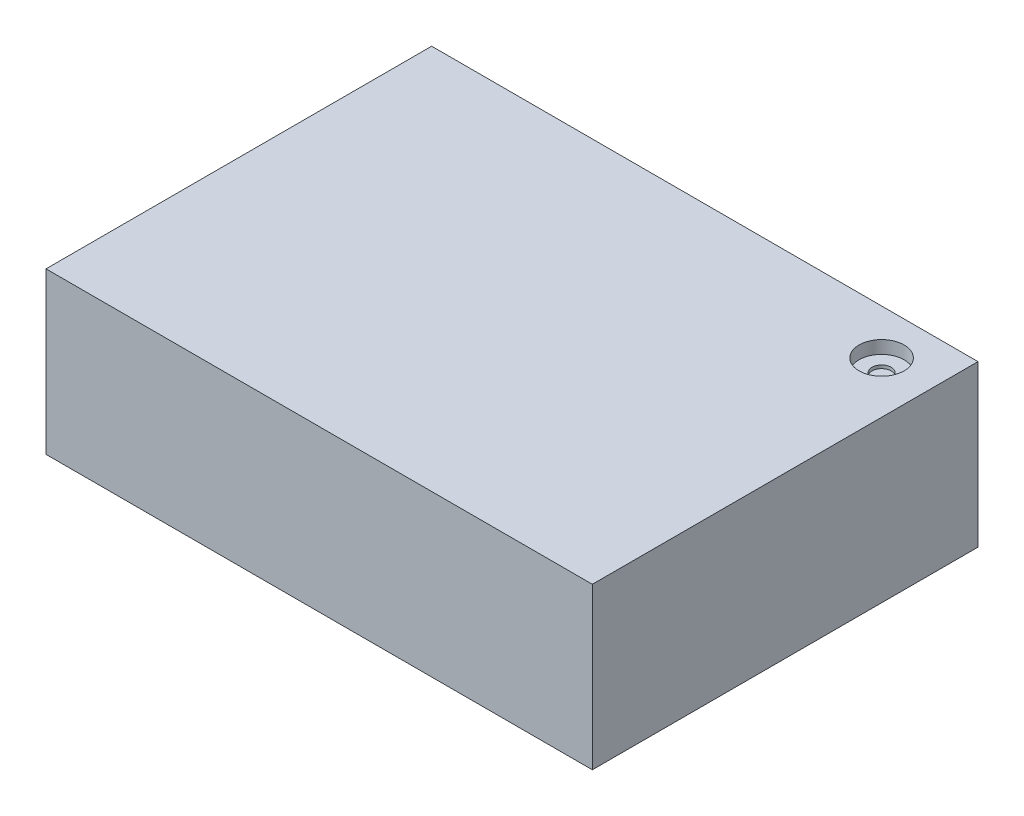
ISO-10303-21;
HEADER;
FILE_DESCRIPTION(('STEP AP214'),'2;1');
FILE_NAME('part.step','',(''),(''),'','','');
FILE_SCHEMA(('AUTOMOTIVE_DESIGN { 1 0 10303 214 1 1 1 1 }'));
ENDSEC;
DATA;
#1=APPLICATION_CONTEXT('core data for automotive mechanical design processes');
#2=APPLICATION_PROTOCOL_DEFINITION('international standard','automotive_design',2000,#1);
#3=PRODUCT_CONTEXT('',#1,'mechanical');
#4=PRODUCT('Part','Part','',(#3));
#5=PRODUCT_RELATED_PRODUCT_CATEGORY('part','',(#4));
#6=PRODUCT_DEFINITION_FORMATION('','',#4);
#7=PRODUCT_DEFINITION_CONTEXT('part definition',#1,'design');
#8=PRODUCT_DEFINITION('design','',#6,#7);
#9=PRODUCT_DEFINITION_SHAPE('','',#8);
#10=(LENGTH_UNIT() NAMED_UNIT(*) SI_UNIT(.MILLI.,.METRE.));
#11=(NAMED_UNIT(*) PLANE_ANGLE_UNIT() SI_UNIT($,.RADIAN.));
#12=(NAMED_UNIT(*) SI_UNIT($,.STERADIAN.) SOLID_ANGLE_UNIT());
#13=UNCERTAINTY_MEASURE_WITH_UNIT(LENGTH_MEASURE(1.E-05),#10,'distance_accuracy_value','');
#14=(GEOMETRIC_REPRESENTATION_CONTEXT(3) GLOBAL_UNCERTAINTY_ASSIGNED_CONTEXT((#13)) GLOBAL_UNIT_ASSIGNED_CONTEXT((#10,
#11,#12)) REPRESENTATION_CONTEXT('',''));
#15=CARTESIAN_POINT('',(0.,0.,0.));
#16=DIRECTION('',(0.,0.,1.));
#17=DIRECTION('',(1.,0.,0.));
#18=AXIS2_PLACEMENT_3D('',#15,#16,#17);
#19=CARTESIAN_POINT('',(43.815,0.,-29.21));
#20=DIRECTION('',(0.,1.,0.));
#21=DIRECTION('',(0.,0.,1.));
#22=AXIS2_PLACEMENT_3D('',#19,#20,#21);
#23=CYLINDRICAL_SURFACE('',#22,1.8923);
#24=CARTESIAN_POINT('',(43.815,28.575,-29.21));
#25=DIRECTION('',(0.,1.,0.));
#26=DIRECTION('',(0.,0.,1.));
#27=AXIS2_PLACEMENT_3D('',#24,#25,#26);
#28=CIRCLE('',#27,1.8923);
#29=CARTESIAN_POINT('',(43.815,28.575,-27.3177));
#30=VERTEX_POINT('',#29);
#31=EDGE_CURVE('E252',#30,#30,#28,.T.);
#32=ORIENTED_EDGE('',*,*,#31,.F.);
#33=EDGE_LOOP('',(#32));
#34=FACE_BOUND('',#33,.T.);
#35=CARTESIAN_POINT('',(43.815,29.21,-29.21));
#36=DIRECTION('',(0.,1.,0.));
#37=DIRECTION('',(0.,0.,1.));
#38=AXIS2_PLACEMENT_3D('',#35,#36,#37);
#39=CIRCLE('',#38,1.8923);
#40=CARTESIAN_POINT('',(43.815,29.21,-27.3177));
#41=VERTEX_POINT('',#40);
#42=EDGE_CURVE('E41',#41,#41,#39,.F.);
#43=ORIENTED_EDGE('',*,*,#42,.F.);
#44=EDGE_LOOP('',(#43));
#45=FACE_BOUND('',#44,.T.);
#46=ADVANCED_FACE('F37',(#34,#45),#23,.F.);
#47=CARTESIAN_POINT('',(53.975,31.75,-38.1));
#48=DIRECTION('',(-1.,0.,0.));
#49=DIRECTION('',(0.,0.,1.));
#50=AXIS2_PLACEMENT_3D('',#47,#48,#49);
#51=PLANE('',#50);
#52=DIRECTION('',(0.,0.,-1.));
#53=VECTOR('',#52,1.);
#54=CARTESIAN_POINT('',(53.975,0.,-38.1));
#55=LINE('',#54,#53);
#56=CARTESIAN_POINT('',(53.975,0.,38.1));
#57=VERTEX_POINT('',#56);
#58=CARTESIAN_POINT('',(53.975,0.,-38.1));
#59=VERTEX_POINT('',#58);
#60=EDGE_CURVE('E290',#57,#59,#55,.T.);
#61=ORIENTED_EDGE('',*,*,#60,.T.);
#62=DIRECTION('',(0.,-1.,0.));
#63=VECTOR('',#62,1.);
#64=CARTESIAN_POINT('',(53.975,31.75,-38.1));
#65=LINE('',#64,#63);
#66=CARTESIAN_POINT('',(53.975,31.75,-38.1));
#67=VERTEX_POINT('',#66);
#68=EDGE_CURVE('E12',#67,#59,#65,.T.);
#69=ORIENTED_EDGE('',*,*,#68,.F.);
#70=DIRECTION('',(0.,0.,-1.));
#71=VECTOR('',#70,1.);
#72=CARTESIAN_POINT('',(53.975,31.75,-38.1));
#73=LINE('',#72,#71);
#74=CARTESIAN_POINT('',(53.975,31.75,38.1));
#75=VERTEX_POINT('',#74);
#76=EDGE_CURVE('E291',#75,#67,#73,.T.);
#77=ORIENTED_EDGE('',*,*,#76,.F.);
#78=DIRECTION('',(0.,-1.,0.));
#79=VECTOR('',#78,1.);
#80=CARTESIAN_POINT('',(53.975,31.75,38.1));
#81=LINE('',#80,#79);
#82=EDGE_CURVE('E301',#75,#57,#81,.T.);
#83=ORIENTED_EDGE('',*,*,#82,.T.);
#84=EDGE_LOOP('',(#61,#69,#77,#83));
#85=FACE_BOUND('',#84,.T.);
#86=ADVANCED_FACE('F39',(#85),#51,.F.);
#87=CARTESIAN_POINT('',(-53.975,31.75,-38.1));
#88=DIRECTION('',(0.,0.,1.));
#89=DIRECTION('',(1.,0.,0.));
#90=AXIS2_PLACEMENT_3D('',#87,#88,#89);
#91=PLANE('',#90);
#92=DIRECTION('',(0.,1.,0.));
#93=VECTOR('',#92,1.);
#94=CARTESIAN_POINT('',(50.8,21.3783333333333,-38.0999999999999));
#95=LINE('',#94,#93);
#96=CARTESIAN_POINT('',(50.8,15.6633333333333,-38.0999999999999));
#97=VERTEX_POINT('',#96);
#98=CARTESIAN_POINT('',(50.8,21.3783333333333,-38.0999999999999));
#99=VERTEX_POINT('',#98);
#100=EDGE_CURVE('E216',#97,#99,#95,.T.);
#101=ORIENTED_EDGE('',*,*,#100,.T.);
#102=DIRECTION('',(-1.,0.,0.));
#103=VECTOR('',#102,1.);
#104=CARTESIAN_POINT('',(127.223289058517,21.3783333333333,-38.0999999999999));
#105=LINE('',#104,#103);
#106=CARTESIAN_POINT('',(-53.975,21.3783333333333,-38.0999999999999));
#107=VERTEX_POINT('',#106);
#108=EDGE_CURVE('E208',#99,#107,#105,.T.);
#109=ORIENTED_EDGE('',*,*,#108,.T.);
#110=DIRECTION('',(0.,-1.,0.));
#111=VECTOR('',#110,1.);
#112=CARTESIAN_POINT('',(-53.975,31.75,-38.1));
#113=LINE('',#112,#111);
#114=CARTESIAN_POINT('',(-53.975,22.86,-38.1));
#115=VERTEX_POINT('',#114);
#116=EDGE_CURVE('E317',#115,#107,#113,.T.);
#117=ORIENTED_EDGE('',*,*,#116,.F.);
#118=DIRECTION('',(-1.,0.,0.));
#119=VECTOR('',#118,1.);
#120=CARTESIAN_POINT('',(127.223289058517,22.86,-38.1));
#121=LINE('',#120,#119);
#122=CARTESIAN_POINT('',(50.8,22.86,-38.1));
#123=VERTEX_POINT('',#122);
#124=EDGE_CURVE('E281',#123,#115,#121,.T.);
#125=ORIENTED_EDGE('',*,*,#124,.F.);
#126=DIRECTION('',(0.,1.,0.));
#127=VECTOR('',#126,1.);
#128=CARTESIAN_POINT('',(50.8,28.575,-38.1));
#129=LINE('',#128,#127);
#130=CARTESIAN_POINT('',(50.8,28.575,-38.1));
#131=VERTEX_POINT('',#130);
#132=EDGE_CURVE('E270',#123,#131,#129,.T.);
#133=ORIENTED_EDGE('',*,*,#132,.T.);
#134=DIRECTION('',(-1.,0.,0.));
#135=VECTOR('',#134,1.);
#136=CARTESIAN_POINT('',(127.223289058517,28.575,-38.1));
#137=LINE('',#136,#135);
#138=CARTESIAN_POINT('',(-53.975,28.575,-38.1));
#139=VERTEX_POINT('',#138);
#140=EDGE_CURVE('E268',#131,#139,#137,.T.);
#141=ORIENTED_EDGE('',*,*,#140,.T.);
#142=CARTESIAN_POINT('',(-53.975,31.75,-38.1));
#143=VERTEX_POINT('',#142);
#144=EDGE_CURVE('E46',#143,#139,#113,.T.);
#145=ORIENTED_EDGE('',*,*,#144,.F.);
#146=DIRECTION('',(-1.,0.,0.));
#147=VECTOR('',#146,1.);
#148=CARTESIAN_POINT('',(-53.975,31.75,-38.1));
#149=LINE('',#148,#147);
#150=EDGE_CURVE('E294',#67,#143,#149,.T.);
#151=ORIENTED_EDGE('',*,*,#150,.F.);
#152=ORIENTED_EDGE('',*,*,#68,.T.);
#153=DIRECTION('',(-1.,0.,0.));
#154=VECTOR('',#153,1.);
#155=CARTESIAN_POINT('',(-53.975,0.,-38.1));
#156=LINE('',#155,#154);
#157=CARTESIAN_POINT('',(-53.975,0.,-38.1));
#158=VERTEX_POINT('',#157);
#159=EDGE_CURVE('E304',#59,#158,#156,.T.);
#160=ORIENTED_EDGE('',*,*,#159,.T.);
#161=CARTESIAN_POINT('',(-53.975,1.27,-38.1));
#162=VERTEX_POINT('',#161);
#163=EDGE_CURVE('E315',#162,#158,#113,.T.);
#164=ORIENTED_EDGE('',*,*,#163,.F.);
#165=DIRECTION('',(-1.,0.,0.));
#166=VECTOR('',#165,1.);
#167=CARTESIAN_POINT('',(127.223289058517,1.27,-38.0999999999997));
#168=LINE('',#167,#166);
#169=CARTESIAN_POINT('',(50.8,1.27,-38.0999999999997));
#170=VERTEX_POINT('',#169);
#171=EDGE_CURVE('E54',#170,#162,#168,.T.);
#172=ORIENTED_EDGE('',*,*,#171,.F.);
#173=DIRECTION('',(0.,1.,0.));
#174=VECTOR('',#173,1.);
#175=CARTESIAN_POINT('',(50.8,6.985,-38.0999999999997));
#176=LINE('',#175,#174);
#177=CARTESIAN_POINT('',(50.8,6.985,-38.0999999999997));
#178=VERTEX_POINT('',#177);
#179=EDGE_CURVE('E246',#170,#178,#176,.T.);
#180=ORIENTED_EDGE('',*,*,#179,.T.);
#181=DIRECTION('',(-1.,0.,0.));
#182=VECTOR('',#181,1.);
#183=CARTESIAN_POINT('',(127.223289058517,6.985,-38.0999999999997));
#184=LINE('',#183,#182);
#185=CARTESIAN_POINT('',(-53.975,6.985,-38.0999999999997));
#186=VERTEX_POINT('',#185);
#187=EDGE_CURVE('E244',#178,#186,#184,.T.);
#188=ORIENTED_EDGE('',*,*,#187,.T.);
#189=CARTESIAN_POINT('',(-53.975,8.46666666666666,-38.1));
#190=VERTEX_POINT('',#189);
#191=EDGE_CURVE('E427',#190,#186,#113,.T.);
#192=ORIENTED_EDGE('',*,*,#191,.F.);
#193=DIRECTION('',(-1.,0.,0.));
#194=VECTOR('',#193,1.);
#195=CARTESIAN_POINT('',(127.223289058517,8.46666666666667,-38.0999999999998));
#196=LINE('',#195,#194);
#197=CARTESIAN_POINT('',(50.8,8.46666666666667,-38.0999999999998));
#198=VERTEX_POINT('',#197);
#199=EDGE_CURVE('E62',#198,#190,#196,.T.);
#200=ORIENTED_EDGE('',*,*,#199,.F.);
#201=DIRECTION('',(0.,1.,0.));
#202=VECTOR('',#201,1.);
#203=CARTESIAN_POINT('',(50.8,14.1816666666667,-38.0999999999998));
#204=LINE('',#203,#202);
#205=CARTESIAN_POINT('',(50.8,14.1816666666667,-38.0999999999998));
#206=VERTEX_POINT('',#205);
#207=EDGE_CURVE('E222',#198,#206,#204,.T.);
#208=ORIENTED_EDGE('',*,*,#207,.T.);
#209=DIRECTION('',(-1.,0.,0.));
#210=VECTOR('',#209,1.);
#211=CARTESIAN_POINT('',(127.223289058517,14.1816666666667,-38.0999999999998));
#212=LINE('',#211,#210);
#213=CARTESIAN_POINT('',(-53.975,14.1816666666667,-38.0999999999998));
#214=VERTEX_POINT('',#213);
#215=EDGE_CURVE('E220',#206,#214,#212,.T.);
#216=ORIENTED_EDGE('',*,*,#215,.T.);
#217=CARTESIAN_POINT('',(-53.975,15.6633333333333,-38.1));
#218=VERTEX_POINT('',#217);
#219=EDGE_CURVE('E429',#218,#214,#113,.T.);
#220=ORIENTED_EDGE('',*,*,#219,.F.);
#221=DIRECTION('',(-1.,0.,0.));
#222=VECTOR('',#221,1.);
#223=CARTESIAN_POINT('',(127.223289058517,15.6633333333333,-38.0999999999999));
#224=LINE('',#223,#222);
#225=EDGE_CURVE('E190',#97,#218,#224,.T.);
#226=ORIENTED_EDGE('',*,*,#225,.F.);
#227=EDGE_LOOP('',(#101,#109,#117,#125,#133,#141,#145,#151,#152,#160,#164,#172,#180,#188,#192,
#200,#208,#216,#220,#226));
#228=FACE_BOUND('',#227,.T.);
#229=ADVANCED_FACE('F358',(#228),#91,.F.);
#230=CARTESIAN_POINT('',(-53.975,31.75,-38.1));
#231=DIRECTION('',(1.,0.,0.));
#232=DIRECTION('',(0.,0.,-1.));
#233=AXIS2_PLACEMENT_3D('',#230,#231,#232);
#234=PLANE('',#233);
#235=ORIENTED_EDGE('',*,*,#116,.T.);
#236=DIRECTION('',(0.,0.,-1.));
#237=VECTOR('',#236,1.);
#238=CARTESIAN_POINT('',(-53.975,21.3783333333333,-38.0999999999999));
#239=LINE('',#238,#237);
#240=CARTESIAN_POINT('',(-53.975,21.3783333333333,34.9250000000001));
#241=VERTEX_POINT('',#240);
#242=EDGE_CURVE('E203',#241,#107,#239,.T.);
#243=ORIENTED_EDGE('',*,*,#242,.F.);
#244=DIRECTION('',(0.,1.,0.));
#245=VECTOR('',#244,1.);
#246=CARTESIAN_POINT('',(-53.975,21.3783333333333,34.9250000000001));
#247=LINE('',#246,#245);
#248=CARTESIAN_POINT('',(-53.975,15.6633333333333,34.9250000000001));
#249=VERTEX_POINT('',#248);
#250=EDGE_CURVE('E183',#249,#241,#247,.T.);
#251=ORIENTED_EDGE('',*,*,#250,.F.);
#252=DIRECTION('',(0.,0.,1.));
#253=VECTOR('',#252,1.);
#254=CARTESIAN_POINT('',(-53.975,15.6633333333333,-38.0999999999999));
#255=LINE('',#254,#253);
#256=EDGE_CURVE('E193',#218,#249,#255,.T.);
#257=ORIENTED_EDGE('',*,*,#256,.F.);
#258=ORIENTED_EDGE('',*,*,#219,.T.);
#259=DIRECTION('',(0.,0.,-1.));
#260=VECTOR('',#259,1.);
#261=CARTESIAN_POINT('',(-53.975,14.1816666666667,-38.0999999999998));
#262=LINE('',#261,#260);
#263=CARTESIAN_POINT('',(-53.975,14.1816666666667,34.9250000000002));
#264=VERTEX_POINT('',#263);
#265=EDGE_CURVE('E231',#264,#214,#262,.T.);
#266=ORIENTED_EDGE('',*,*,#265,.F.);
#267=DIRECTION('',(0.,1.,0.));
#268=VECTOR('',#267,1.);
#269=CARTESIAN_POINT('',(-53.975,14.1816666666667,34.9250000000002));
#270=LINE('',#269,#268);
#271=CARTESIAN_POINT('',(-53.975,8.46666666666667,34.9250000000002));
#272=VERTEX_POINT('',#271);
#273=EDGE_CURVE('E227',#272,#264,#270,.T.);
#274=ORIENTED_EDGE('',*,*,#273,.F.);
#275=DIRECTION('',(0.,0.,1.));
#276=VECTOR('',#275,1.);
#277=CARTESIAN_POINT('',(-53.975,8.46666666666667,-38.0999999999998));
#278=LINE('',#277,#276);
#279=EDGE_CURVE('E225',#190,#272,#278,.T.);
#280=ORIENTED_EDGE('',*,*,#279,.F.);
#281=ORIENTED_EDGE('',*,*,#191,.T.);
#282=DIRECTION('',(0.,0.,-1.));
#283=VECTOR('',#282,1.);
#284=CARTESIAN_POINT('',(-53.975,6.985,-38.0999999999997));
#285=LINE('',#284,#283);
#286=CARTESIAN_POINT('',(-53.975,6.985,34.9250000000003));
#287=VERTEX_POINT('',#286);
#288=EDGE_CURVE('E255',#287,#186,#285,.T.);
#289=ORIENTED_EDGE('',*,*,#288,.F.);
#290=DIRECTION('',(0.,1.,0.));
#291=VECTOR('',#290,1.);
#292=CARTESIAN_POINT('',(-53.975,6.985,34.9250000000003));
#293=LINE('',#292,#291);
#294=CARTESIAN_POINT('',(-53.975,1.27,34.9250000000003));
#295=VERTEX_POINT('',#294);
#296=EDGE_CURVE('E251',#295,#287,#293,.T.);
#297=ORIENTED_EDGE('',*,*,#296,.F.);
#298=DIRECTION('',(0.,0.,1.));
#299=VECTOR('',#298,1.);
#300=CARTESIAN_POINT('',(-53.975,1.27,-38.0999999999997));
#301=LINE('',#300,#299);
#302=EDGE_CURVE('E249',#162,#295,#301,.T.);
#303=ORIENTED_EDGE('',*,*,#302,.F.);
#304=ORIENTED_EDGE('',*,*,#163,.T.);
#305=DIRECTION('',(0.,0.,1.));
#306=VECTOR('',#305,1.);
#307=CARTESIAN_POINT('',(-53.975,0.,-38.1));
#308=LINE('',#307,#306);
#309=CARTESIAN_POINT('',(-53.975,0.,38.1));
#310=VERTEX_POINT('',#309);
#311=EDGE_CURVE('E307',#158,#310,#308,.T.);
#312=ORIENTED_EDGE('',*,*,#311,.T.);
#313=DIRECTION('',(0.,-1.,0.));
#314=VECTOR('',#313,1.);
#315=CARTESIAN_POINT('',(-53.975,31.75,38.1));
#316=LINE('',#315,#314);
#317=CARTESIAN_POINT('',(-53.975,31.75,38.1));
#318=VERTEX_POINT('',#317);
#319=EDGE_CURVE('E312',#318,#310,#316,.T.);
#320=ORIENTED_EDGE('',*,*,#319,.F.);
#321=DIRECTION('',(0.,0.,1.));
#322=VECTOR('',#321,1.);
#323=CARTESIAN_POINT('',(-53.975,31.75,-38.1));
#324=LINE('',#323,#322);
#325=EDGE_CURVE('E297',#143,#318,#324,.T.);
#326=ORIENTED_EDGE('',*,*,#325,.F.);
#327=ORIENTED_EDGE('',*,*,#144,.T.);
#328=DIRECTION('',(0.,0.,-1.));
#329=VECTOR('',#328,1.);
#330=CARTESIAN_POINT('',(-53.975,28.575,-38.1));
#331=LINE('',#330,#329);
#332=CARTESIAN_POINT('',(-53.975,28.575,34.925));
#333=VERTEX_POINT('',#332);
#334=EDGE_CURVE('E279',#333,#139,#331,.T.);
#335=ORIENTED_EDGE('',*,*,#334,.F.);
#336=DIRECTION('',(0.,1.,0.));
#337=VECTOR('',#336,1.);
#338=CARTESIAN_POINT('',(-53.975,28.575,34.925));
#339=LINE('',#338,#337);
#340=CARTESIAN_POINT('',(-53.975,22.86,34.925));
#341=VERTEX_POINT('',#340);
#342=EDGE_CURVE('E276',#341,#333,#339,.T.);
#343=ORIENTED_EDGE('',*,*,#342,.F.);
#344=DIRECTION('',(0.,0.,1.));
#345=VECTOR('',#344,1.);
#346=CARTESIAN_POINT('',(-53.975,22.86,-38.1));
#347=LINE('',#346,#345);
#348=EDGE_CURVE('E215',#115,#341,#347,.T.);
#349=ORIENTED_EDGE('',*,*,#348,.F.);
#350=EDGE_LOOP('',(#235,#243,#251,#257,#258,#266,#274,#280,#281,#289,#297,#303,#304,#312,#320,
#326,#327,#335,#343,#349));
#351=FACE_BOUND('',#350,.T.);
#352=ADVANCED_FACE('F202',(#351),#234,.F.);
#353=CARTESIAN_POINT('',(-53.975,31.75,38.1));
#354=DIRECTION('',(0.,0.,-1.));
#355=DIRECTION('',(-1.,0.,0.));
#356=AXIS2_PLACEMENT_3D('',#353,#354,#355);
#357=PLANE('',#356);
#358=DIRECTION('',(1.,0.,0.));
#359=VECTOR('',#358,1.);
#360=CARTESIAN_POINT('',(-53.975,0.,38.1));
#361=LINE('',#360,#359);
#362=EDGE_CURVE('E295',#310,#57,#361,.T.);
#363=ORIENTED_EDGE('',*,*,#362,.T.);
#364=ORIENTED_EDGE('',*,*,#82,.F.);
#365=DIRECTION('',(1.,0.,0.));
#366=VECTOR('',#365,1.);
#367=CARTESIAN_POINT('',(-53.975,31.75,38.1));
#368=LINE('',#367,#366);
#369=EDGE_CURVE('E299',#318,#75,#368,.T.);
#370=ORIENTED_EDGE('',*,*,#369,.F.);
#371=ORIENTED_EDGE('',*,*,#319,.T.);
#372=EDGE_LOOP('',(#363,#364,#370,#371));
#373=FACE_BOUND('',#372,.T.);
#374=ADVANCED_FACE('F463',(#373),#357,.F.);
#375=CARTESIAN_POINT('',(0.,31.75,0.));
#376=DIRECTION('',(0.,1.,0.));
#377=DIRECTION('',(0.,0.,1.));
#378=AXIS2_PLACEMENT_3D('',#375,#376,#377);
#379=PLANE('',#378);
#380=CARTESIAN_POINT('',(43.815,31.75,-29.21));
#381=DIRECTION('',(0.,1.,0.));
#382=DIRECTION('',(0.,0.,1.));
#383=AXIS2_PLACEMENT_3D('',#380,#381,#382);
#384=CIRCLE('',#383,4.44499999999999);
#385=CARTESIAN_POINT('',(43.815,31.75,-24.765));
#386=VERTEX_POINT('',#385);
#387=EDGE_CURVE('E334',#386,#386,#384,.T.);
#388=ORIENTED_EDGE('',*,*,#387,.F.);
#389=EDGE_LOOP('',(#388));
#390=FACE_BOUND('',#389,.T.);
#391=ORIENTED_EDGE('',*,*,#76,.T.);
#392=ORIENTED_EDGE('',*,*,#150,.T.);
#393=ORIENTED_EDGE('',*,*,#325,.T.);
#394=ORIENTED_EDGE('',*,*,#369,.T.);
#395=EDGE_LOOP('',(#391,#392,#393,#394));
#396=FACE_BOUND('',#395,.T.);
#397=ADVANCED_FACE('F454',(#390,#396),#379,.T.);
#398=CARTESIAN_POINT('',(0.,0.,0.));
#399=DIRECTION('',(0.,1.,0.));
#400=DIRECTION('',(0.,0.,1.));
#401=AXIS2_PLACEMENT_3D('',#398,#399,#400);
#402=PLANE('',#401);
#403=CARTESIAN_POINT('',(43.815,0.,-29.21));
#404=DIRECTION('',(0.,1.,0.));
#405=DIRECTION('',(0.,0.,1.));
#406=AXIS2_PLACEMENT_3D('',#403,#404,#405);
#407=CIRCLE('',#406,1.8923);
#408=CARTESIAN_POINT('',(43.815,0.,-27.3177));
#409=VERTEX_POINT('',#408);
#410=EDGE_CURVE('E321',#409,#409,#407,.T.);
#411=ORIENTED_EDGE('',*,*,#410,.T.);
#412=EDGE_LOOP('',(#411));
#413=FACE_BOUND('',#412,.T.);
#414=ORIENTED_EDGE('',*,*,#60,.F.);
#415=ORIENTED_EDGE('',*,*,#362,.F.);
#416=ORIENTED_EDGE('',*,*,#311,.F.);
#417=ORIENTED_EDGE('',*,*,#159,.F.);
#418=EDGE_LOOP('',(#414,#415,#416,#417));
#419=FACE_BOUND('',#418,.T.);
#420=ADVANCED_FACE('F461',(#413,#419),#402,.F.);
#421=CARTESIAN_POINT('',(127.223289058517,28.575,-38.1));
#422=DIRECTION('',(0.,1.,0.));
#423=DIRECTION('',(0.,0.,1.));
#424=AXIS2_PLACEMENT_3D('',#421,#422,#423);
#425=PLANE('',#424);
#426=ORIENTED_EDGE('',*,*,#31,.T.);
#427=EDGE_LOOP('',(#426));
#428=FACE_BOUND('',#427,.T.);
#429=DIRECTION('',(0.,0.,1.));
#430=VECTOR('',#429,1.);
#431=CARTESIAN_POINT('',(50.8,28.575,-38.1));
#432=LINE('',#431,#430);
#433=CARTESIAN_POINT('',(50.8,28.575,34.925));
#434=VERTEX_POINT('',#433);
#435=EDGE_CURVE('E267',#131,#434,#432,.T.);
#436=ORIENTED_EDGE('',*,*,#435,.T.);
#437=DIRECTION('',(-1.,0.,0.));
#438=VECTOR('',#437,1.);
#439=CARTESIAN_POINT('',(127.223289058517,28.575,34.925));
#440=LINE('',#439,#438);
#441=EDGE_CURVE('E284',#434,#333,#440,.T.);
#442=ORIENTED_EDGE('',*,*,#441,.T.);
#443=ORIENTED_EDGE('',*,*,#334,.T.);
#444=ORIENTED_EDGE('',*,*,#140,.F.);
#445=EDGE_LOOP('',(#436,#442,#443,#444));
#446=FACE_BOUND('',#445,.T.);
#447=ADVANCED_FACE('F447',(#428,#446),#425,.F.);
#448=CARTESIAN_POINT('',(127.223289058517,28.575,34.925));
#449=DIRECTION('',(0.,0.,1.));
#450=DIRECTION('',(1.,0.,0.));
#451=AXIS2_PLACEMENT_3D('',#448,#449,#450);
#452=PLANE('',#451);
#453=DIRECTION('',(0.,-1.,0.));
#454=VECTOR('',#453,1.);
#455=CARTESIAN_POINT('',(50.8,28.575,34.925));
#456=LINE('',#455,#454);
#457=CARTESIAN_POINT('',(50.8,22.86,34.925));
#458=VERTEX_POINT('',#457);
#459=EDGE_CURVE('E265',#434,#458,#456,.T.);
#460=ORIENTED_EDGE('',*,*,#459,.T.);
#461=DIRECTION('',(-1.,0.,0.));
#462=VECTOR('',#461,1.);
#463=CARTESIAN_POINT('',(127.223289058517,22.86,34.925));
#464=LINE('',#463,#462);
#465=EDGE_CURVE('E286',#458,#341,#464,.T.);
#466=ORIENTED_EDGE('',*,*,#465,.T.);
#467=ORIENTED_EDGE('',*,*,#342,.T.);
#468=ORIENTED_EDGE('',*,*,#441,.F.);
#469=EDGE_LOOP('',(#460,#466,#467,#468));
#470=FACE_BOUND('',#469,.T.);
#471=ADVANCED_FACE('F489',(#470),#452,.F.);
#472=CARTESIAN_POINT('',(127.223289058517,22.86,-38.1));
#473=DIRECTION('',(0.,-1.,0.));
#474=DIRECTION('',(0.,0.,-1.));
#475=AXIS2_PLACEMENT_3D('',#472,#473,#474);
#476=PLANE('',#475);
#477=CARTESIAN_POINT('',(43.815,22.86,-29.21));
#478=DIRECTION('',(0.,-1.,0.));
#479=DIRECTION('',(0.,0.,-1.));
#480=AXIS2_PLACEMENT_3D('',#477,#478,#479);
#481=CIRCLE('',#480,1.8923);
#482=CARTESIAN_POINT('',(43.815,22.86,-31.1023));
#483=VERTEX_POINT('',#482);
#484=EDGE_CURVE('E348',#483,#483,#481,.T.);
#485=ORIENTED_EDGE('',*,*,#484,.T.);
#486=EDGE_LOOP('',(#485));
#487=FACE_BOUND('',#486,.T.);
#488=DIRECTION('',(0.,0.,-1.));
#489=VECTOR('',#488,1.);
#490=CARTESIAN_POINT('',(50.8,22.86,-38.1));
#491=LINE('',#490,#489);
#492=EDGE_CURVE('E273',#458,#123,#491,.T.);
#493=ORIENTED_EDGE('',*,*,#492,.T.);
#494=ORIENTED_EDGE('',*,*,#124,.T.);
#495=ORIENTED_EDGE('',*,*,#348,.T.);
#496=ORIENTED_EDGE('',*,*,#465,.F.);
#497=EDGE_LOOP('',(#493,#494,#495,#496));
#498=FACE_BOUND('',#497,.T.);
#499=ADVANCED_FACE('F438',(#487,#498),#476,.F.);
#500=CARTESIAN_POINT('',(50.8,31.75,-38.1));
#501=DIRECTION('',(-1.,0.,0.));
#502=DIRECTION('',(0.,0.,1.));
#503=AXIS2_PLACEMENT_3D('',#500,#501,#502);
#504=PLANE('',#503);
#505=ORIENTED_EDGE('',*,*,#132,.F.);
#506=ORIENTED_EDGE('',*,*,#492,.F.);
#507=ORIENTED_EDGE('',*,*,#459,.F.);
#508=ORIENTED_EDGE('',*,*,#435,.F.);
#509=EDGE_LOOP('',(#505,#506,#507,#508));
#510=FACE_BOUND('',#509,.T.);
#511=ADVANCED_FACE('F443',(#510),#504,.T.);
#512=CARTESIAN_POINT('',(127.223289058517,6.985,-38.0999999999997));
#513=DIRECTION('',(0.,1.,0.));
#514=DIRECTION('',(0.,0.,1.));
#515=AXIS2_PLACEMENT_3D('',#512,#513,#514);
#516=PLANE('',#515);
#517=CARTESIAN_POINT('',(43.815,6.985,-29.21));
#518=DIRECTION('',(0.,1.,0.));
#519=DIRECTION('',(0.,0.,1.));
#520=AXIS2_PLACEMENT_3D('',#517,#518,#519);
#521=CIRCLE('',#520,1.8923);
#522=CARTESIAN_POINT('',(43.815,6.985,-27.3177));
#523=VERTEX_POINT('',#522);
#524=EDGE_CURVE('E345',#523,#523,#521,.T.);
#525=ORIENTED_EDGE('',*,*,#524,.T.);
#526=EDGE_LOOP('',(#525));
#527=FACE_BOUND('',#526,.T.);
#528=DIRECTION('',(0.,0.,1.));
#529=VECTOR('',#528,1.);
#530=CARTESIAN_POINT('',(50.8,6.985,-38.0999999999997));
#531=LINE('',#530,#529);
#532=CARTESIAN_POINT('',(50.8,6.985,34.9250000000003));
#533=VERTEX_POINT('',#532);
#534=EDGE_CURVE('E243',#178,#533,#531,.T.);
#535=ORIENTED_EDGE('',*,*,#534,.T.);
#536=DIRECTION('',(-1.,0.,0.));
#537=VECTOR('',#536,1.);
#538=CARTESIAN_POINT('',(127.223289058517,6.985,34.9250000000003));
#539=LINE('',#538,#537);
#540=EDGE_CURVE('E259',#533,#287,#539,.T.);
#541=ORIENTED_EDGE('',*,*,#540,.T.);
#542=ORIENTED_EDGE('',*,*,#288,.T.);
#543=ORIENTED_EDGE('',*,*,#187,.F.);
#544=EDGE_LOOP('',(#535,#541,#542,#543));
#545=FACE_BOUND('',#544,.T.);
#546=ADVANCED_FACE('F507',(#527,#545),#516,.F.);
#547=CARTESIAN_POINT('',(127.223289058517,6.985,34.9250000000003));
#548=DIRECTION('',(0.,0.,1.));
#549=DIRECTION('',(0.,-1.,0.));
#550=AXIS2_PLACEMENT_3D('',#547,#548,#549);
#551=PLANE('',#550);
#552=DIRECTION('',(0.,-1.,0.));
#553=VECTOR('',#552,1.);
#554=CARTESIAN_POINT('',(50.8,6.985,34.9250000000003));
#555=LINE('',#554,#553);
#556=CARTESIAN_POINT('',(50.8,1.27,34.9250000000003));
#557=VERTEX_POINT('',#556);
#558=EDGE_CURVE('E241',#533,#557,#555,.T.);
#559=ORIENTED_EDGE('',*,*,#558,.T.);
#560=DIRECTION('',(-1.,0.,0.));
#561=VECTOR('',#560,1.);
#562=CARTESIAN_POINT('',(127.223289058517,1.27,34.9250000000003));
#563=LINE('',#562,#561);
#564=EDGE_CURVE('E261',#557,#295,#563,.T.);
#565=ORIENTED_EDGE('',*,*,#564,.T.);
#566=ORIENTED_EDGE('',*,*,#296,.T.);
#567=ORIENTED_EDGE('',*,*,#540,.F.);
#568=EDGE_LOOP('',(#559,#565,#566,#567));
#569=FACE_BOUND('',#568,.T.);
#570=ADVANCED_FACE('F417',(#569),#551,.F.);
#571=CARTESIAN_POINT('',(127.223289058517,1.27,-38.0999999999997));
#572=DIRECTION('',(0.,-1.,0.));
#573=DIRECTION('',(0.,0.,-1.));
#574=AXIS2_PLACEMENT_3D('',#571,#572,#573);
#575=PLANE('',#574);
#576=CARTESIAN_POINT('',(43.815,1.27,-29.21));
#577=DIRECTION('',(0.,-1.,0.));
#578=DIRECTION('',(0.,0.,-1.));
#579=AXIS2_PLACEMENT_3D('',#576,#577,#578);
#580=CIRCLE('',#579,1.8923);
#581=CARTESIAN_POINT('',(43.815,1.27,-31.1023));
#582=VERTEX_POINT('',#581);
#583=EDGE_CURVE('E342',#582,#582,#580,.T.);
#584=ORIENTED_EDGE('',*,*,#583,.T.);
#585=EDGE_LOOP('',(#584));
#586=FACE_BOUND('',#585,.T.);
#587=DIRECTION('',(0.,0.,-1.));
#588=VECTOR('',#587,1.);
#589=CARTESIAN_POINT('',(50.8,1.27,-38.0999999999997));
#590=LINE('',#589,#588);
#591=EDGE_CURVE('E228',#557,#170,#590,.T.);
#592=ORIENTED_EDGE('',*,*,#591,.T.);
#593=ORIENTED_EDGE('',*,*,#171,.T.);
#594=ORIENTED_EDGE('',*,*,#302,.T.);
#595=ORIENTED_EDGE('',*,*,#564,.F.);
#596=EDGE_LOOP('',(#592,#593,#594,#595));
#597=FACE_BOUND('',#596,.T.);
#598=ADVANCED_FACE('F414',(#586,#597),#575,.F.);
#599=CARTESIAN_POINT('',(50.8,31.75,-38.1));
#600=DIRECTION('',(-1.,0.,0.));
#601=DIRECTION('',(0.,0.,1.));
#602=AXIS2_PLACEMENT_3D('',#599,#600,#601);
#603=PLANE('',#602);
#604=ORIENTED_EDGE('',*,*,#179,.F.);
#605=ORIENTED_EDGE('',*,*,#591,.F.);
#606=ORIENTED_EDGE('',*,*,#558,.F.);
#607=ORIENTED_EDGE('',*,*,#534,.F.);
#608=EDGE_LOOP('',(#604,#605,#606,#607));
#609=FACE_BOUND('',#608,.T.);
#610=ADVANCED_FACE('F416',(#609),#603,.T.);
#611=CARTESIAN_POINT('',(127.223289058517,14.1816666666667,-38.0999999999998));
#612=DIRECTION('',(0.,1.,0.));
#613=DIRECTION('',(0.,0.,1.));
#614=AXIS2_PLACEMENT_3D('',#611,#612,#613);
#615=PLANE('',#614);
#616=CARTESIAN_POINT('',(43.815,14.1816666666667,-29.21));
#617=DIRECTION('',(0.,1.,0.));
#618=DIRECTION('',(0.,0.,1.));
#619=AXIS2_PLACEMENT_3D('',#616,#617,#618);
#620=CIRCLE('',#619,1.8923);
#621=CARTESIAN_POINT('',(43.815,14.1816666666667,-27.3177));
#622=VERTEX_POINT('',#621);
#623=EDGE_CURVE('E339',#622,#622,#620,.T.);
#624=ORIENTED_EDGE('',*,*,#623,.T.);
#625=EDGE_LOOP('',(#624));
#626=FACE_BOUND('',#625,.T.);
#627=DIRECTION('',(0.,0.,1.));
#628=VECTOR('',#627,1.);
#629=CARTESIAN_POINT('',(50.8,14.1816666666667,-38.0999999999998));
#630=LINE('',#629,#628);
#631=CARTESIAN_POINT('',(50.8,14.1816666666667,34.9250000000002));
#632=VERTEX_POINT('',#631);
#633=EDGE_CURVE('E219',#206,#632,#630,.T.);
#634=ORIENTED_EDGE('',*,*,#633,.T.);
#635=DIRECTION('',(-1.,0.,0.));
#636=VECTOR('',#635,1.);
#637=CARTESIAN_POINT('',(127.223289058517,14.1816666666667,34.9250000000002));
#638=LINE('',#637,#636);
#639=EDGE_CURVE('E235',#632,#264,#638,.T.);
#640=ORIENTED_EDGE('',*,*,#639,.T.);
#641=ORIENTED_EDGE('',*,*,#265,.T.);
#642=ORIENTED_EDGE('',*,*,#215,.F.);
#643=EDGE_LOOP('',(#634,#640,#641,#642));
#644=FACE_BOUND('',#643,.T.);
#645=ADVANCED_FACE('F528',(#626,#644),#615,.F.);
#646=CARTESIAN_POINT('',(127.223289058517,14.1816666666667,34.9250000000002));
#647=DIRECTION('',(0.,0.,1.));
#648=DIRECTION('',(1.,0.,0.));
#649=AXIS2_PLACEMENT_3D('',#646,#647,#648);
#650=PLANE('',#649);
#651=DIRECTION('',(0.,-1.,0.));
#652=VECTOR('',#651,1.);
#653=CARTESIAN_POINT('',(50.8,14.1816666666667,34.9250000000002));
#654=LINE('',#653,#652);
#655=CARTESIAN_POINT('',(50.8,8.46666666666667,34.9250000000002));
#656=VERTEX_POINT('',#655);
#657=EDGE_CURVE('E217',#632,#656,#654,.T.);
#658=ORIENTED_EDGE('',*,*,#657,.T.);
#659=DIRECTION('',(-1.,0.,0.));
#660=VECTOR('',#659,1.);
#661=CARTESIAN_POINT('',(127.223289058517,8.46666666666667,34.9250000000002));
#662=LINE('',#661,#660);
#663=EDGE_CURVE('E237',#656,#272,#662,.T.);
#664=ORIENTED_EDGE('',*,*,#663,.T.);
#665=ORIENTED_EDGE('',*,*,#273,.T.);
#666=ORIENTED_EDGE('',*,*,#639,.F.);
#667=EDGE_LOOP('',(#658,#664,#665,#666));
#668=FACE_BOUND('',#667,.T.);
#669=ADVANCED_FACE('F535',(#668),#650,.F.);
#670=CARTESIAN_POINT('',(127.223289058517,8.46666666666667,-38.0999999999998));
#671=DIRECTION('',(0.,-1.,0.));
#672=DIRECTION('',(0.,0.,-1.));
#673=AXIS2_PLACEMENT_3D('',#670,#671,#672);
#674=PLANE('',#673);
#675=CARTESIAN_POINT('',(43.815,8.46666666666667,-29.21));
#676=DIRECTION('',(0.,-1.,0.));
#677=DIRECTION('',(0.,0.,-1.));
#678=AXIS2_PLACEMENT_3D('',#675,#676,#677);
#679=CIRCLE('',#678,1.8923);
#680=CARTESIAN_POINT('',(43.815,8.46666666666667,-31.1023));
#681=VERTEX_POINT('',#680);
#682=EDGE_CURVE('E325',#681,#681,#679,.T.);
#683=ORIENTED_EDGE('',*,*,#682,.T.);
#684=EDGE_LOOP('',(#683));
#685=FACE_BOUND('',#684,.T.);
#686=DIRECTION('',(0.,0.,-1.));
#687=VECTOR('',#686,1.);
#688=CARTESIAN_POINT('',(50.8,8.46666666666667,-38.0999999999998));
#689=LINE('',#688,#687);
#690=EDGE_CURVE('E199',#656,#198,#689,.T.);
#691=ORIENTED_EDGE('',*,*,#690,.T.);
#692=ORIENTED_EDGE('',*,*,#199,.T.);
#693=ORIENTED_EDGE('',*,*,#279,.T.);
#694=ORIENTED_EDGE('',*,*,#663,.F.);
#695=EDGE_LOOP('',(#691,#692,#693,#694));
#696=FACE_BOUND('',#695,.T.);
#697=ADVANCED_FACE('F374',(#685,#696),#674,.F.);
#698=CARTESIAN_POINT('',(50.8,31.75,-38.1));
#699=DIRECTION('',(-1.,0.,0.));
#700=DIRECTION('',(0.,0.,1.));
#701=AXIS2_PLACEMENT_3D('',#698,#699,#700);
#702=PLANE('',#701);
#703=ORIENTED_EDGE('',*,*,#207,.F.);
#704=ORIENTED_EDGE('',*,*,#690,.F.);
#705=ORIENTED_EDGE('',*,*,#657,.F.);
#706=ORIENTED_EDGE('',*,*,#633,.F.);
#707=EDGE_LOOP('',(#703,#704,#705,#706));
#708=FACE_BOUND('',#707,.T.);
#709=ADVANCED_FACE('F366',(#708),#702,.T.);
#710=CARTESIAN_POINT('',(127.223289058517,21.3783333333333,-38.0999999999999));
#711=DIRECTION('',(0.,1.,0.));
#712=DIRECTION('',(0.,0.,1.));
#713=AXIS2_PLACEMENT_3D('',#710,#711,#712);
#714=PLANE('',#713);
#715=CARTESIAN_POINT('',(43.815,21.3783333333333,-29.21));
#716=DIRECTION('',(0.,1.,0.));
#717=DIRECTION('',(0.,0.,1.));
#718=AXIS2_PLACEMENT_3D('',#715,#716,#717);
#719=CIRCLE('',#718,1.8923);
#720=CARTESIAN_POINT('',(43.815,21.3783333333333,-27.3177));
#721=VERTEX_POINT('',#720);
#722=EDGE_CURVE('E320',#721,#721,#719,.T.);
#723=ORIENTED_EDGE('',*,*,#722,.T.);
#724=EDGE_LOOP('',(#723));
#725=FACE_BOUND('',#724,.T.);
#726=DIRECTION('',(0.,0.,1.));
#727=VECTOR('',#726,1.);
#728=CARTESIAN_POINT('',(50.8,21.3783333333333,-38.0999999999999));
#729=LINE('',#728,#727);
#730=CARTESIAN_POINT('',(50.8,21.3783333333333,34.9250000000001));
#731=VERTEX_POINT('',#730);
#732=EDGE_CURVE('E354',#99,#731,#729,.T.);
#733=ORIENTED_EDGE('',*,*,#732,.T.);
#734=DIRECTION('',(-1.,0.,0.));
#735=VECTOR('',#734,1.);
#736=CARTESIAN_POINT('',(127.223289058517,21.3783333333333,34.9250000000001));
#737=LINE('',#736,#735);
#738=EDGE_CURVE('E189',#731,#241,#737,.T.);
#739=ORIENTED_EDGE('',*,*,#738,.T.);
#740=ORIENTED_EDGE('',*,*,#242,.T.);
#741=ORIENTED_EDGE('',*,*,#108,.F.);
#742=EDGE_LOOP('',(#733,#739,#740,#741));
#743=FACE_BOUND('',#742,.T.);
#744=ADVANCED_FACE('F364',(#725,#743),#714,.F.);
#745=CARTESIAN_POINT('',(127.223289058517,21.3783333333333,34.9250000000001));
#746=DIRECTION('',(0.,0.,1.));
#747=DIRECTION('',(1.,0.,0.));
#748=AXIS2_PLACEMENT_3D('',#745,#746,#747);
#749=PLANE('',#748);
#750=DIRECTION('',(0.,-1.,0.));
#751=VECTOR('',#750,1.);
#752=CARTESIAN_POINT('',(50.8,21.3783333333333,34.9250000000001));
#753=LINE('',#752,#751);
#754=CARTESIAN_POINT('',(50.8,15.6633333333333,34.9250000000001));
#755=VERTEX_POINT('',#754);
#756=EDGE_CURVE('E186',#731,#755,#753,.T.);
#757=ORIENTED_EDGE('',*,*,#756,.T.);
#758=DIRECTION('',(-1.,0.,0.));
#759=VECTOR('',#758,1.);
#760=CARTESIAN_POINT('',(127.223289058517,15.6633333333333,34.9250000000001));
#761=LINE('',#760,#759);
#762=EDGE_CURVE('E178',#755,#249,#761,.T.);
#763=ORIENTED_EDGE('',*,*,#762,.T.);
#764=ORIENTED_EDGE('',*,*,#250,.T.);
#765=ORIENTED_EDGE('',*,*,#738,.F.);
#766=EDGE_LOOP('',(#757,#763,#764,#765));
#767=FACE_BOUND('',#766,.T.);
#768=ADVANCED_FACE('F180',(#767),#749,.F.);
#769=CARTESIAN_POINT('',(127.223289058517,15.6633333333333,-38.0999999999999));
#770=DIRECTION('',(0.,-1.,0.));
#771=DIRECTION('',(0.,0.,-1.));
#772=AXIS2_PLACEMENT_3D('',#769,#770,#771);
#773=PLANE('',#772);
#774=CARTESIAN_POINT('',(43.815,15.6633333333333,-29.21));
#775=DIRECTION('',(0.,-1.,0.));
#776=DIRECTION('',(0.,0.,-1.));
#777=AXIS2_PLACEMENT_3D('',#774,#775,#776);
#778=CIRCLE('',#777,1.8923);
#779=CARTESIAN_POINT('',(43.815,15.6633333333333,-31.1023));
#780=VERTEX_POINT('',#779);
#781=EDGE_CURVE('E318',#780,#780,#778,.T.);
#782=ORIENTED_EDGE('',*,*,#781,.T.);
#783=EDGE_LOOP('',(#782));
#784=FACE_BOUND('',#783,.T.);
#785=DIRECTION('',(0.,0.,-1.));
#786=VECTOR('',#785,1.);
#787=CARTESIAN_POINT('',(50.8,15.6633333333333,-38.0999999999999));
#788=LINE('',#787,#786);
#789=EDGE_CURVE('E213',#755,#97,#788,.T.);
#790=ORIENTED_EDGE('',*,*,#789,.T.);
#791=ORIENTED_EDGE('',*,*,#225,.T.);
#792=ORIENTED_EDGE('',*,*,#256,.T.);
#793=ORIENTED_EDGE('',*,*,#762,.F.);
#794=EDGE_LOOP('',(#790,#791,#792,#793));
#795=FACE_BOUND('',#794,.T.);
#796=ADVANCED_FACE('F194',(#784,#795),#773,.F.);
#797=CARTESIAN_POINT('',(50.8,31.75,-38.1));
#798=DIRECTION('',(-1.,0.,0.));
#799=DIRECTION('',(0.,0.,1.));
#800=AXIS2_PLACEMENT_3D('',#797,#798,#799);
#801=PLANE('',#800);
#802=ORIENTED_EDGE('',*,*,#100,.F.);
#803=ORIENTED_EDGE('',*,*,#789,.F.);
#804=ORIENTED_EDGE('',*,*,#756,.F.);
#805=ORIENTED_EDGE('',*,*,#732,.F.);
#806=EDGE_LOOP('',(#802,#803,#804,#805));
#807=FACE_BOUND('',#806,.T.);
#808=ADVANCED_FACE('F362',(#807),#801,.T.);
#809=ORIENTED_EDGE('',*,*,#781,.F.);
#810=EDGE_LOOP('',(#809));
#811=FACE_BOUND('',#810,.T.);
#812=ORIENTED_EDGE('',*,*,#623,.F.);
#813=EDGE_LOOP('',(#812));
#814=FACE_BOUND('',#813,.T.);
#815=ADVANCED_FACE('F382',(#811,#814),#23,.F.);
#816=ORIENTED_EDGE('',*,*,#722,.F.);
#817=EDGE_LOOP('',(#816));
#818=FACE_BOUND('',#817,.T.);
#819=ORIENTED_EDGE('',*,*,#484,.F.);
#820=EDGE_LOOP('',(#819));
#821=FACE_BOUND('',#820,.T.);
#822=ADVANCED_FACE('F381',(#818,#821),#23,.F.);
#823=ORIENTED_EDGE('',*,*,#682,.F.);
#824=EDGE_LOOP('',(#823));
#825=FACE_BOUND('',#824,.T.);
#826=ORIENTED_EDGE('',*,*,#524,.F.);
#827=EDGE_LOOP('',(#826));
#828=FACE_BOUND('',#827,.T.);
#829=ADVANCED_FACE('F391',(#825,#828),#23,.F.);
#830=ORIENTED_EDGE('',*,*,#410,.F.);
#831=EDGE_LOOP('',(#830));
#832=FACE_BOUND('',#831,.T.);
#833=ORIENTED_EDGE('',*,*,#583,.F.);
#834=EDGE_LOOP('',(#833));
#835=FACE_BOUND('',#834,.T.);
#836=ADVANCED_FACE('F395',(#832,#835),#23,.F.);
#837=CARTESIAN_POINT('',(43.815,29.21,-29.21));
#838=DIRECTION('',(0.,1.,0.));
#839=DIRECTION('',(0.,0.,1.));
#840=AXIS2_PLACEMENT_3D('',#837,#838,#839);
#841=PLANE('',#840);
#842=CARTESIAN_POINT('',(43.815,29.21,-29.21));
#843=DIRECTION('',(0.,1.,0.));
#844=DIRECTION('',(0.,0.,1.));
#845=AXIS2_PLACEMENT_3D('',#842,#843,#844);
#846=CIRCLE('',#845,4.44499999999999);
#847=CARTESIAN_POINT('',(43.815,29.21,-24.765));
#848=VERTEX_POINT('',#847);
#849=EDGE_CURVE('E332',#848,#848,#846,.T.);
#850=ORIENTED_EDGE('',*,*,#849,.T.);
#851=EDGE_LOOP('',(#850));
#852=FACE_BOUND('',#851,.T.);
#853=ORIENTED_EDGE('',*,*,#42,.T.);
#854=EDGE_LOOP('',(#853));
#855=FACE_BOUND('',#854,.T.);
#856=ADVANCED_FACE('F401',(#852,#855),#841,.T.);
#857=CARTESIAN_POINT('',(43.815,29.21,-29.21));
#858=DIRECTION('',(0.,1.,0.));
#859=DIRECTION('',(0.,0.,1.));
#860=AXIS2_PLACEMENT_3D('',#857,#858,#859);
#861=CYLINDRICAL_SURFACE('',#860,4.44499999999999);
#862=ORIENTED_EDGE('',*,*,#849,.F.);
#863=EDGE_LOOP('',(#862));
#864=FACE_BOUND('',#863,.T.);
#865=ORIENTED_EDGE('',*,*,#387,.T.);
#866=EDGE_LOOP('',(#865));
#867=FACE_BOUND('',#866,.T.);
#868=ADVANCED_FACE('F407',(#864,#867),#861,.F.);
#869=CLOSED_SHELL('',(#46,#86,#229,#352,#374,#397,#420,#447,#471,#499,#511,#546,#570,#598,#610,
#645,#669,#697,#709,#744,#768,#796,#808,#815,#822,#829,#836,#856,#868));
#870=MANIFOLD_SOLID_BREP('B2',#869);
#871=ADVANCED_BREP_SHAPE_REPRESENTATION('',(#18,#870),#14);
#872=SHAPE_DEFINITION_REPRESENTATION(#9,#871);
ENDSEC;
END-ISO-10303-21;
